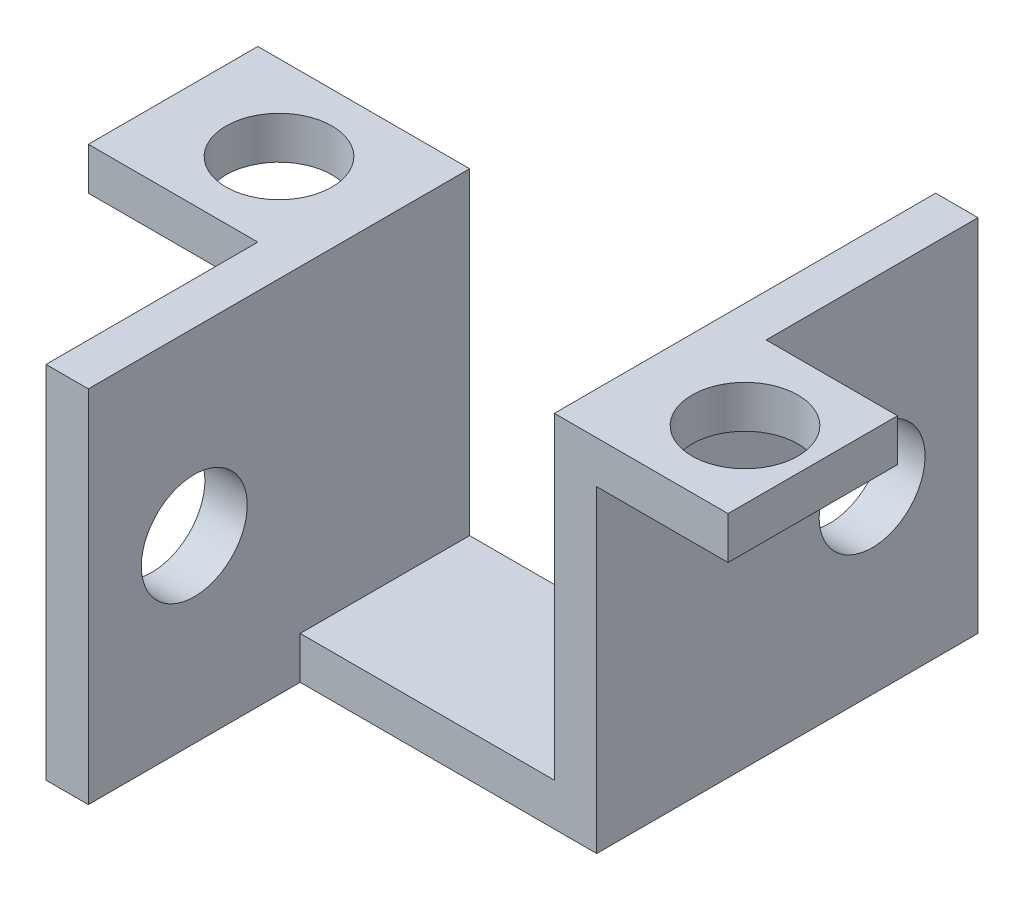
ISO-10303-21;
HEADER;
FILE_DESCRIPTION(('STEP AP214'),'2;1');
FILE_NAME('part.step','',(''),(''),'','','');
FILE_SCHEMA(('AUTOMOTIVE_DESIGN { 1 0 10303 214 1 1 1 1 }'));
ENDSEC;
DATA;
#1=APPLICATION_CONTEXT('core data for automotive mechanical design processes');
#2=APPLICATION_PROTOCOL_DEFINITION('international standard','automotive_design',2000,#1);
#3=PRODUCT_CONTEXT('',#1,'mechanical');
#4=PRODUCT('Part','Part','',(#3));
#5=PRODUCT_RELATED_PRODUCT_CATEGORY('part','',(#4));
#6=PRODUCT_DEFINITION_FORMATION('','',#4);
#7=PRODUCT_DEFINITION_CONTEXT('part definition',#1,'design');
#8=PRODUCT_DEFINITION('design','',#6,#7);
#9=PRODUCT_DEFINITION_SHAPE('','',#8);
#10=(LENGTH_UNIT() NAMED_UNIT(*) SI_UNIT(.MILLI.,.METRE.));
#11=(NAMED_UNIT(*) PLANE_ANGLE_UNIT() SI_UNIT($,.RADIAN.));
#12=(NAMED_UNIT(*) SI_UNIT($,.STERADIAN.) SOLID_ANGLE_UNIT());
#13=UNCERTAINTY_MEASURE_WITH_UNIT(LENGTH_MEASURE(1.E-05),#10,'distance_accuracy_value','');
#14=(GEOMETRIC_REPRESENTATION_CONTEXT(3) GLOBAL_UNCERTAINTY_ASSIGNED_CONTEXT((#13)) GLOBAL_UNIT_ASSIGNED_CONTEXT((#10,
#11,#12)) REPRESENTATION_CONTEXT('',''));
#15=CARTESIAN_POINT('',(0.,0.,0.));
#16=DIRECTION('',(0.,0.,1.));
#17=DIRECTION('',(1.,0.,0.));
#18=AXIS2_PLACEMENT_3D('',#15,#16,#17);
#19=CARTESIAN_POINT('',(0.,0.,0.));
#20=DIRECTION('',(0.,0.,1.));
#21=DIRECTION('',(1.,0.,0.));
#22=AXIS2_PLACEMENT_3D('',#19,#20,#21);
#23=PLANE('',#22);
#24=DIRECTION('',(0.,-1.,0.));
#25=VECTOR('',#24,1.);
#26=CARTESIAN_POINT('',(8.,-9.5,0.));
#27=LINE('',#26,#25);
#28=CARTESIAN_POINT('',(8.,7.5,0.));
#29=VERTEX_POINT('',#28);
#30=CARTESIAN_POINT('',(8.,5.5,0.));
#31=VERTEX_POINT('',#30);
#32=EDGE_CURVE('E188',#29,#31,#27,.T.);
#33=ORIENTED_EDGE('',*,*,#32,.F.);
#34=DIRECTION('',(-1.,0.,0.));
#35=VECTOR('',#34,1.);
#36=CARTESIAN_POINT('',(0.,7.49999999999999,0.));
#37=LINE('',#36,#35);
#38=CARTESIAN_POINT('',(14.2,7.5,0.));
#39=VERTEX_POINT('',#38);
#40=EDGE_CURVE('E306',#39,#29,#37,.T.);
#41=ORIENTED_EDGE('',*,*,#40,.F.);
#42=DIRECTION('',(0.,1.,0.));
#43=VECTOR('',#42,1.);
#44=CARTESIAN_POINT('',(14.2,7.5,0.));
#45=LINE('',#44,#43);
#46=CARTESIAN_POINT('',(14.2,5.5,0.));
#47=VERTEX_POINT('',#46);
#48=EDGE_CURVE('E229',#47,#39,#45,.T.);
#49=ORIENTED_EDGE('',*,*,#48,.F.);
#50=DIRECTION('',(1.,0.,0.));
#51=VECTOR('',#50,1.);
#52=CARTESIAN_POINT('',(0.,5.5,0.));
#53=LINE('',#52,#51);
#54=EDGE_CURVE('E302',#31,#47,#53,.T.);
#55=ORIENTED_EDGE('',*,*,#54,.F.);
#56=EDGE_LOOP('',(#33,#41,#49,#55));
#57=FACE_BOUND('',#56,.T.);
#58=ADVANCED_FACE('F41',(#57),#23,.F.);
#59=CARTESIAN_POINT('',(0.,0.,8.));
#60=DIRECTION('',(0.,0.,1.));
#61=DIRECTION('',(1.,0.,0.));
#62=AXIS2_PLACEMENT_3D('',#59,#60,#61);
#63=PLANE('',#62);
#64=DIRECTION('',(-1.,0.,0.));
#65=VECTOR('',#64,1.);
#66=CARTESIAN_POINT('',(0.,5.5,8.));
#67=LINE('',#66,#65);
#68=CARTESIAN_POINT('',(-8.,5.5,8.));
#69=VERTEX_POINT('',#68);
#70=CARTESIAN_POINT('',(-16.,5.5,8.));
#71=VERTEX_POINT('',#70);
#72=EDGE_CURVE('E259',#69,#71,#67,.T.);
#73=ORIENTED_EDGE('',*,*,#72,.F.);
#74=DIRECTION('',(0.,1.,0.));
#75=VECTOR('',#74,1.);
#76=CARTESIAN_POINT('',(-8.,-9.50000000000001,8.));
#77=LINE('',#76,#75);
#78=CARTESIAN_POINT('',(-8.,7.5,8.));
#79=VERTEX_POINT('',#78);
#80=EDGE_CURVE('E51',#69,#79,#77,.T.);
#81=ORIENTED_EDGE('',*,*,#80,.T.);
#82=DIRECTION('',(-1.,0.,0.));
#83=VECTOR('',#82,1.);
#84=CARTESIAN_POINT('',(0.,7.5,8.));
#85=LINE('',#84,#83);
#86=CARTESIAN_POINT('',(-16.,7.5,8.));
#87=VERTEX_POINT('',#86);
#88=EDGE_CURVE('E252',#79,#87,#85,.T.);
#89=ORIENTED_EDGE('',*,*,#88,.T.);
#90=DIRECTION('',(0.,-1.,0.));
#91=VECTOR('',#90,1.);
#92=CARTESIAN_POINT('',(-16.,0.,8.));
#93=LINE('',#92,#91);
#94=EDGE_CURVE('E255',#87,#71,#93,.T.);
#95=ORIENTED_EDGE('',*,*,#94,.T.);
#96=EDGE_LOOP('',(#73,#81,#89,#95));
#97=FACE_BOUND('',#96,.T.);
#98=ADVANCED_FACE('F365',(#97),#63,.T.);
#99=CARTESIAN_POINT('',(0.,5.5,8.));
#100=DIRECTION('',(0.,1.,0.));
#101=DIRECTION('',(0.,0.,1.));
#102=AXIS2_PLACEMENT_3D('',#99,#100,#101);
#103=PLANE('',#102);
#104=CARTESIAN_POINT('',(11.,5.5,4.));
#105=DIRECTION('',(0.,1.,0.));
#106=DIRECTION('',(-1.,0.,0.));
#107=AXIS2_PLACEMENT_3D('',#104,#105,#106);
#108=CIRCLE('',#107,2.5);
#109=CARTESIAN_POINT('',(8.5,5.5,4.));
#110=VERTEX_POINT('',#109);
#111=EDGE_CURVE('E245',#110,#110,#108,.T.);
#112=ORIENTED_EDGE('',*,*,#111,.T.);
#113=EDGE_LOOP('',(#112));
#114=FACE_BOUND('',#113,.T.);
#115=DIRECTION('',(0.,0.,-1.));
#116=VECTOR('',#115,1.);
#117=CARTESIAN_POINT('',(14.2,5.5,8.));
#118=LINE('',#117,#116);
#119=CARTESIAN_POINT('',(14.2,5.5,8.));
#120=VERTEX_POINT('',#119);
#121=EDGE_CURVE('E226',#120,#47,#118,.T.);
#122=ORIENTED_EDGE('',*,*,#121,.F.);
#123=DIRECTION('',(1.,0.,0.));
#124=VECTOR('',#123,1.);
#125=CARTESIAN_POINT('',(0.,5.5,8.));
#126=LINE('',#125,#124);
#127=CARTESIAN_POINT('',(8.,5.5,8.));
#128=VERTEX_POINT('',#127);
#129=EDGE_CURVE('E270',#128,#120,#126,.T.);
#130=ORIENTED_EDGE('',*,*,#129,.F.);
#131=DIRECTION('',(0.,0.,-1.));
#132=VECTOR('',#131,1.);
#133=CARTESIAN_POINT('',(8.,5.5,8.));
#134=LINE('',#133,#132);
#135=EDGE_CURVE('E328',#128,#31,#134,.T.);
#136=ORIENTED_EDGE('',*,*,#135,.T.);
#137=ORIENTED_EDGE('',*,*,#54,.T.);
#138=EDGE_LOOP('',(#122,#130,#136,#137));
#139=FACE_BOUND('',#138,.T.);
#140=ADVANCED_FACE('F385',(#114,#139),#103,.F.);
#141=CARTESIAN_POINT('',(0.,7.49999999999999,8.));
#142=DIRECTION('',(0.,-1.,0.));
#143=DIRECTION('',(1.,0.,0.));
#144=AXIS2_PLACEMENT_3D('',#141,#142,#143);
#145=PLANE('',#144);
#146=CARTESIAN_POINT('',(11.,7.5,4.));
#147=DIRECTION('',(0.,1.,0.));
#148=DIRECTION('',(-1.,0.,0.));
#149=AXIS2_PLACEMENT_3D('',#146,#147,#148);
#150=CIRCLE('',#149,2.5);
#151=CARTESIAN_POINT('',(8.5,7.5,4.));
#152=VERTEX_POINT('',#151);
#153=EDGE_CURVE('E235',#152,#152,#150,.T.);
#154=ORIENTED_EDGE('',*,*,#153,.F.);
#155=EDGE_LOOP('',(#154));
#156=FACE_BOUND('',#155,.T.);
#157=DIRECTION('',(0.,0.,1.));
#158=VECTOR('',#157,1.);
#159=CARTESIAN_POINT('',(14.2,7.5,8.));
#160=LINE('',#159,#158);
#161=CARTESIAN_POINT('',(14.2,7.5,8.));
#162=VERTEX_POINT('',#161);
#163=EDGE_CURVE('E232',#39,#162,#160,.T.);
#164=ORIENTED_EDGE('',*,*,#163,.F.);
#165=ORIENTED_EDGE('',*,*,#40,.T.);
#166=DIRECTION('',(0.,0.,1.));
#167=VECTOR('',#166,1.);
#168=CARTESIAN_POINT('',(8.,7.5,0.));
#169=LINE('',#168,#167);
#170=CARTESIAN_POINT('',(8.,7.5,-10.));
#171=VERTEX_POINT('',#170);
#172=EDGE_CURVE('E182',#171,#29,#169,.T.);
#173=ORIENTED_EDGE('',*,*,#172,.F.);
#174=DIRECTION('',(1.,0.,0.));
#175=VECTOR('',#174,1.);
#176=CARTESIAN_POINT('',(6.,7.5,-10.));
#177=LINE('',#176,#175);
#178=CARTESIAN_POINT('',(6.,7.5,-10.));
#179=VERTEX_POINT('',#178);
#180=EDGE_CURVE('E167',#179,#171,#177,.T.);
#181=ORIENTED_EDGE('',*,*,#180,.F.);
#182=DIRECTION('',(0.,0.,-1.));
#183=VECTOR('',#182,1.);
#184=CARTESIAN_POINT('',(6.,7.5,8.));
#185=LINE('',#184,#183);
#186=CARTESIAN_POINT('',(6.,7.5,8.));
#187=VERTEX_POINT('',#186);
#188=EDGE_CURVE('E173',#187,#179,#185,.T.);
#189=ORIENTED_EDGE('',*,*,#188,.F.);
#190=DIRECTION('',(-1.,0.,0.));
#191=VECTOR('',#190,1.);
#192=CARTESIAN_POINT('',(0.,7.49999999999999,8.));
#193=LINE('',#192,#191);
#194=EDGE_CURVE('E274',#162,#187,#193,.T.);
#195=ORIENTED_EDGE('',*,*,#194,.F.);
#196=EDGE_LOOP('',(#164,#165,#173,#181,#189,#195));
#197=FACE_BOUND('',#196,.T.);
#198=ADVANCED_FACE('F392',(#156,#197),#145,.F.);
#199=DIRECTION('',(0.,1.,0.));
#200=VECTOR('',#199,1.);
#201=CARTESIAN_POINT('',(-6.,-9.50000000000001,8.));
#202=LINE('',#201,#200);
#203=CARTESIAN_POINT('',(-6.,-9.5,8.));
#204=VERTEX_POINT('',#203);
#205=CARTESIAN_POINT('',(-6.,-7.5,8.));
#206=VERTEX_POINT('',#205);
#207=EDGE_CURVE('E66',#204,#206,#202,.T.);
#208=ORIENTED_EDGE('',*,*,#207,.F.);
#209=DIRECTION('',(-1.,0.,0.));
#210=VECTOR('',#209,1.);
#211=CARTESIAN_POINT('',(0.,-9.5,8.));
#212=LINE('',#211,#210);
#213=CARTESIAN_POINT('',(8.,-9.5,8.));
#214=VERTEX_POINT('',#213);
#215=EDGE_CURVE('E263',#214,#204,#212,.T.);
#216=ORIENTED_EDGE('',*,*,#215,.F.);
#217=DIRECTION('',(0.,-1.,0.));
#218=VECTOR('',#217,1.);
#219=CARTESIAN_POINT('',(8.,0.,8.));
#220=LINE('',#219,#218);
#221=EDGE_CURVE('E266',#128,#214,#220,.T.);
#222=ORIENTED_EDGE('',*,*,#221,.F.);
#223=ORIENTED_EDGE('',*,*,#129,.T.);
#224=DIRECTION('',(0.,-1.,0.));
#225=VECTOR('',#224,1.);
#226=CARTESIAN_POINT('',(14.2,7.5,8.));
#227=LINE('',#226,#225);
#228=EDGE_CURVE('E223',#162,#120,#227,.T.);
#229=ORIENTED_EDGE('',*,*,#228,.F.);
#230=ORIENTED_EDGE('',*,*,#194,.T.);
#231=DIRECTION('',(0.,1.,0.));
#232=VECTOR('',#231,1.);
#233=CARTESIAN_POINT('',(6.,0.,8.));
#234=LINE('',#233,#232);
#235=CARTESIAN_POINT('',(6.,-7.5,8.));
#236=VERTEX_POINT('',#235);
#237=EDGE_CURVE('E277',#236,#187,#234,.T.);
#238=ORIENTED_EDGE('',*,*,#237,.F.);
#239=DIRECTION('',(1.,0.,0.));
#240=VECTOR('',#239,1.);
#241=CARTESIAN_POINT('',(0.,-7.5,8.));
#242=LINE('',#241,#240);
#243=EDGE_CURVE('E280',#206,#236,#242,.T.);
#244=ORIENTED_EDGE('',*,*,#243,.F.);
#245=EDGE_LOOP('',(#208,#216,#222,#223,#229,#230,#238,#244));
#246=FACE_BOUND('',#245,.T.);
#247=ADVANCED_FACE('F376',(#246),#63,.T.);
#248=DIRECTION('',(1.,0.,0.));
#249=VECTOR('',#248,1.);
#250=CARTESIAN_POINT('',(0.,-7.5,0.));
#251=LINE('',#250,#249);
#252=CARTESIAN_POINT('',(-6.,-7.5,0.));
#253=VERTEX_POINT('',#252);
#254=CARTESIAN_POINT('',(6.,-7.5,0.));
#255=VERTEX_POINT('',#254);
#256=EDGE_CURVE('E310',#253,#255,#251,.T.);
#257=ORIENTED_EDGE('',*,*,#256,.T.);
#258=DIRECTION('',(0.,-1.,0.));
#259=VECTOR('',#258,1.);
#260=CARTESIAN_POINT('',(6.,-9.5,0.));
#261=LINE('',#260,#259);
#262=CARTESIAN_POINT('',(6.,-9.5,0.));
#263=VERTEX_POINT('',#262);
#264=EDGE_CURVE('E11',#255,#263,#261,.T.);
#265=ORIENTED_EDGE('',*,*,#264,.T.);
#266=DIRECTION('',(-1.,0.,0.));
#267=VECTOR('',#266,1.);
#268=CARTESIAN_POINT('',(0.,-9.5,0.));
#269=LINE('',#268,#267);
#270=CARTESIAN_POINT('',(-8.,-9.50000000000001,0.));
#271=VERTEX_POINT('',#270);
#272=EDGE_CURVE('E180',#263,#271,#269,.T.);
#273=ORIENTED_EDGE('',*,*,#272,.T.);
#274=DIRECTION('',(0.,-1.,0.));
#275=VECTOR('',#274,1.);
#276=CARTESIAN_POINT('',(-8.,0.,0.));
#277=LINE('',#276,#275);
#278=CARTESIAN_POINT('',(-8.,5.5,0.));
#279=VERTEX_POINT('',#278);
#280=EDGE_CURVE('E296',#279,#271,#277,.T.);
#281=ORIENTED_EDGE('',*,*,#280,.F.);
#282=DIRECTION('',(-1.,0.,0.));
#283=VECTOR('',#282,1.);
#284=CARTESIAN_POINT('',(0.,5.5,0.));
#285=LINE('',#284,#283);
#286=CARTESIAN_POINT('',(-16.,5.5,0.));
#287=VERTEX_POINT('',#286);
#288=EDGE_CURVE('E292',#279,#287,#285,.T.);
#289=ORIENTED_EDGE('',*,*,#288,.T.);
#290=DIRECTION('',(0.,-1.,0.));
#291=VECTOR('',#290,1.);
#292=CARTESIAN_POINT('',(-16.,0.,0.));
#293=LINE('',#292,#291);
#294=CARTESIAN_POINT('',(-16.,7.5,0.));
#295=VERTEX_POINT('',#294);
#296=EDGE_CURVE('E288',#295,#287,#293,.T.);
#297=ORIENTED_EDGE('',*,*,#296,.F.);
#298=DIRECTION('',(-1.,0.,0.));
#299=VECTOR('',#298,1.);
#300=CARTESIAN_POINT('',(0.,7.5,0.));
#301=LINE('',#300,#299);
#302=CARTESIAN_POINT('',(-6.,7.5,0.));
#303=VERTEX_POINT('',#302);
#304=EDGE_CURVE('E240',#303,#295,#301,.T.);
#305=ORIENTED_EDGE('',*,*,#304,.F.);
#306=DIRECTION('',(0.,1.,0.));
#307=VECTOR('',#306,1.);
#308=CARTESIAN_POINT('',(-6.,0.,0.));
#309=LINE('',#308,#307);
#310=EDGE_CURVE('E256',#253,#303,#309,.T.);
#311=ORIENTED_EDGE('',*,*,#310,.F.);
#312=EDGE_LOOP('',(#257,#265,#273,#281,#289,#297,#305,#311));
#313=FACE_BOUND('',#312,.T.);
#314=ADVANCED_FACE('F357',(#313),#23,.F.);
#315=CARTESIAN_POINT('',(0.,7.5,8.));
#316=DIRECTION('',(0.,-1.,0.));
#317=DIRECTION('',(1.,0.,0.));
#318=AXIS2_PLACEMENT_3D('',#315,#316,#317);
#319=PLANE('',#318);
#320=CARTESIAN_POINT('',(-11.,7.49999999999998,4.));
#321=DIRECTION('',(0.,1.,0.));
#322=DIRECTION('',(-1.,0.,0.));
#323=AXIS2_PLACEMENT_3D('',#320,#321,#322);
#324=CIRCLE('',#323,2.5);
#325=CARTESIAN_POINT('',(-13.5,7.49999999999998,4.));
#326=VERTEX_POINT('',#325);
#327=EDGE_CURVE('E241',#326,#326,#324,.T.);
#328=ORIENTED_EDGE('',*,*,#327,.F.);
#329=EDGE_LOOP('',(#328));
#330=FACE_BOUND('',#329,.T.);
#331=ORIENTED_EDGE('',*,*,#304,.T.);
#332=DIRECTION('',(0.,0.,-1.));
#333=VECTOR('',#332,1.);
#334=CARTESIAN_POINT('',(-16.,7.5,8.));
#335=LINE('',#334,#333);
#336=EDGE_CURVE('E45',#87,#295,#335,.T.);
#337=ORIENTED_EDGE('',*,*,#336,.F.);
#338=ORIENTED_EDGE('',*,*,#88,.F.);
#339=DIRECTION('',(0.,0.,1.));
#340=VECTOR('',#339,1.);
#341=CARTESIAN_POINT('',(-8.,7.5,8.));
#342=LINE('',#341,#340);
#343=CARTESIAN_POINT('',(-8.,7.5,18.));
#344=VERTEX_POINT('',#343);
#345=EDGE_CURVE('E195',#79,#344,#342,.T.);
#346=ORIENTED_EDGE('',*,*,#345,.T.);
#347=DIRECTION('',(-1.,0.,0.));
#348=VECTOR('',#347,1.);
#349=CARTESIAN_POINT('',(-6.,7.5,18.));
#350=LINE('',#349,#348);
#351=CARTESIAN_POINT('',(-6.,7.5,18.));
#352=VERTEX_POINT('',#351);
#353=EDGE_CURVE('E220',#352,#344,#350,.T.);
#354=ORIENTED_EDGE('',*,*,#353,.F.);
#355=DIRECTION('',(0.,0.,-1.));
#356=VECTOR('',#355,1.);
#357=CARTESIAN_POINT('',(-6.,7.5,8.));
#358=LINE('',#357,#356);
#359=EDGE_CURVE('E284',#352,#303,#358,.T.);
#360=ORIENTED_EDGE('',*,*,#359,.T.);
#361=EDGE_LOOP('',(#331,#337,#338,#346,#354,#360));
#362=FACE_BOUND('',#361,.T.);
#363=ADVANCED_FACE('F43',(#330,#362),#319,.F.);
#364=CARTESIAN_POINT('',(-16.,0.,8.));
#365=DIRECTION('',(1.,0.,0.));
#366=DIRECTION('',(0.,0.,-1.));
#367=AXIS2_PLACEMENT_3D('',#364,#365,#366);
#368=PLANE('',#367);
#369=ORIENTED_EDGE('',*,*,#296,.T.);
#370=DIRECTION('',(0.,0.,-1.));
#371=VECTOR('',#370,1.);
#372=CARTESIAN_POINT('',(-16.,5.5,8.));
#373=LINE('',#372,#371);
#374=EDGE_CURVE('E340',#71,#287,#373,.T.);
#375=ORIENTED_EDGE('',*,*,#374,.F.);
#376=ORIENTED_EDGE('',*,*,#94,.F.);
#377=ORIENTED_EDGE('',*,*,#336,.T.);
#378=EDGE_LOOP('',(#369,#375,#376,#377));
#379=FACE_BOUND('',#378,.T.);
#380=ADVANCED_FACE('F350',(#379),#368,.F.);
#381=CARTESIAN_POINT('',(0.,5.5,8.));
#382=DIRECTION('',(0.,-1.,0.));
#383=DIRECTION('',(1.,0.,0.));
#384=AXIS2_PLACEMENT_3D('',#381,#382,#383);
#385=PLANE('',#384);
#386=CARTESIAN_POINT('',(-11.,5.49999999999998,4.));
#387=DIRECTION('',(0.,1.,0.));
#388=DIRECTION('',(-1.,0.,0.));
#389=AXIS2_PLACEMENT_3D('',#386,#387,#388);
#390=CIRCLE('',#389,2.5);
#391=CARTESIAN_POINT('',(-13.5,5.49999999999998,4.));
#392=VERTEX_POINT('',#391);
#393=EDGE_CURVE('E236',#392,#392,#390,.T.);
#394=ORIENTED_EDGE('',*,*,#393,.T.);
#395=EDGE_LOOP('',(#394));
#396=FACE_BOUND('',#395,.T.);
#397=ORIENTED_EDGE('',*,*,#288,.F.);
#398=DIRECTION('',(0.,0.,-1.));
#399=VECTOR('',#398,1.);
#400=CARTESIAN_POINT('',(-8.,5.5,8.));
#401=LINE('',#400,#399);
#402=EDGE_CURVE('E338',#69,#279,#401,.T.);
#403=ORIENTED_EDGE('',*,*,#402,.F.);
#404=ORIENTED_EDGE('',*,*,#72,.T.);
#405=ORIENTED_EDGE('',*,*,#374,.T.);
#406=EDGE_LOOP('',(#397,#403,#404,#405));
#407=FACE_BOUND('',#406,.T.);
#408=ADVANCED_FACE('F360',(#396,#407),#385,.T.);
#409=CARTESIAN_POINT('',(-8.,0.,8.));
#410=DIRECTION('',(1.,0.,0.));
#411=DIRECTION('',(0.,0.,-1.));
#412=AXIS2_PLACEMENT_3D('',#409,#410,#411);
#413=PLANE('',#412);
#414=CARTESIAN_POINT('',(-8.,-1.,13.));
#415=DIRECTION('',(-1.,0.,0.));
#416=DIRECTION('',(0.,0.,1.));
#417=AXIS2_PLACEMENT_3D('',#414,#415,#416);
#418=CIRCLE('',#417,2.5);
#419=CARTESIAN_POINT('',(-8.,-1.,15.5));
#420=VERTEX_POINT('',#419);
#421=EDGE_CURVE('E462',#420,#420,#418,.T.);
#422=ORIENTED_EDGE('',*,*,#421,.F.);
#423=EDGE_LOOP('',(#422));
#424=FACE_BOUND('',#423,.T.);
#425=ORIENTED_EDGE('',*,*,#280,.T.);
#426=DIRECTION('',(0.,0.,-1.));
#427=VECTOR('',#426,1.);
#428=CARTESIAN_POINT('',(-8.,-9.50000000000001,8.));
#429=LINE('',#428,#427);
#430=CARTESIAN_POINT('',(-8.,-9.50000000000001,18.));
#431=VERTEX_POINT('',#430);
#432=EDGE_CURVE('E335',#431,#271,#429,.T.);
#433=ORIENTED_EDGE('',*,*,#432,.F.);
#434=DIRECTION('',(0.,1.,0.));
#435=VECTOR('',#434,1.);
#436=CARTESIAN_POINT('',(-8.,-9.50000000000001,18.));
#437=LINE('',#436,#435);
#438=EDGE_CURVE('E202',#431,#344,#437,.T.);
#439=ORIENTED_EDGE('',*,*,#438,.T.);
#440=ORIENTED_EDGE('',*,*,#345,.F.);
#441=ORIENTED_EDGE('',*,*,#80,.F.);
#442=ORIENTED_EDGE('',*,*,#402,.T.);
#443=EDGE_LOOP('',(#425,#433,#439,#440,#441,#442));
#444=FACE_BOUND('',#443,.T.);
#445=ADVANCED_FACE('F367',(#424,#444),#413,.F.);
#446=CARTESIAN_POINT('',(0.,-9.5,8.));
#447=DIRECTION('',(0.,-1.,0.));
#448=DIRECTION('',(1.,0.,0.));
#449=AXIS2_PLACEMENT_3D('',#446,#447,#448);
#450=PLANE('',#449);
#451=ORIENTED_EDGE('',*,*,#272,.F.);
#452=DIRECTION('',(0.,0.,-1.));
#453=VECTOR('',#452,1.);
#454=CARTESIAN_POINT('',(6.,-9.5,0.));
#455=LINE('',#454,#453);
#456=CARTESIAN_POINT('',(6.,-9.5,-10.));
#457=VERTEX_POINT('',#456);
#458=EDGE_CURVE('E59',#263,#457,#455,.T.);
#459=ORIENTED_EDGE('',*,*,#458,.T.);
#460=DIRECTION('',(1.,0.,0.));
#461=VECTOR('',#460,1.);
#462=CARTESIAN_POINT('',(6.,-9.5,-10.));
#463=LINE('',#462,#461);
#464=CARTESIAN_POINT('',(8.,-9.5,-10.));
#465=VERTEX_POINT('',#464);
#466=EDGE_CURVE('E160',#457,#465,#463,.T.);
#467=ORIENTED_EDGE('',*,*,#466,.T.);
#468=DIRECTION('',(0.,0.,-1.));
#469=VECTOR('',#468,1.);
#470=CARTESIAN_POINT('',(8.,-9.5,8.));
#471=LINE('',#470,#469);
#472=EDGE_CURVE('E332',#214,#465,#471,.T.);
#473=ORIENTED_EDGE('',*,*,#472,.F.);
#474=ORIENTED_EDGE('',*,*,#215,.T.);
#475=DIRECTION('',(0.,0.,1.));
#476=VECTOR('',#475,1.);
#477=CARTESIAN_POINT('',(-6.,-9.50000000000001,8.));
#478=LINE('',#477,#476);
#479=CARTESIAN_POINT('',(-6.,-9.50000000000001,18.));
#480=VERTEX_POINT('',#479);
#481=EDGE_CURVE('E201',#204,#480,#478,.T.);
#482=ORIENTED_EDGE('',*,*,#481,.T.);
#483=DIRECTION('',(-1.,0.,0.));
#484=VECTOR('',#483,1.);
#485=CARTESIAN_POINT('',(-6.,-9.50000000000001,18.));
#486=LINE('',#485,#484);
#487=EDGE_CURVE('E208',#480,#431,#486,.T.);
#488=ORIENTED_EDGE('',*,*,#487,.T.);
#489=ORIENTED_EDGE('',*,*,#432,.T.);
#490=EDGE_LOOP('',(#451,#459,#467,#473,#474,#482,#488,#489));
#491=FACE_BOUND('',#490,.T.);
#492=ADVANCED_FACE('F178',(#491),#450,.T.);
#493=CARTESIAN_POINT('',(8.,0.,8.));
#494=DIRECTION('',(1.,0.,0.));
#495=DIRECTION('',(0.,1.,0.));
#496=AXIS2_PLACEMENT_3D('',#493,#494,#495);
#497=PLANE('',#496);
#498=ORIENTED_EDGE('',*,*,#472,.T.);
#499=DIRECTION('',(0.,1.,0.));
#500=VECTOR('',#499,1.);
#501=CARTESIAN_POINT('',(8.,-9.5,-10.));
#502=LINE('',#501,#500);
#503=EDGE_CURVE('E164',#465,#171,#502,.T.);
#504=ORIENTED_EDGE('',*,*,#503,.T.);
#505=ORIENTED_EDGE('',*,*,#172,.T.);
#506=ORIENTED_EDGE('',*,*,#32,.T.);
#507=ORIENTED_EDGE('',*,*,#135,.F.);
#508=ORIENTED_EDGE('',*,*,#221,.T.);
#509=EDGE_LOOP('',(#498,#504,#505,#506,#507,#508));
#510=FACE_BOUND('',#509,.T.);
#511=CARTESIAN_POINT('',(8.,-1.,-5.));
#512=DIRECTION('',(1.,0.,0.));
#513=DIRECTION('',(0.,1.,0.));
#514=AXIS2_PLACEMENT_3D('',#511,#512,#513);
#515=CIRCLE('',#514,2.5);
#516=CARTESIAN_POINT('',(8.,1.5,-5.));
#517=VERTEX_POINT('',#516);
#518=EDGE_CURVE('E467',#517,#517,#515,.T.);
#519=ORIENTED_EDGE('',*,*,#518,.F.);
#520=EDGE_LOOP('',(#519));
#521=FACE_BOUND('',#520,.T.);
#522=ADVANCED_FACE('F378',(#510,#521),#497,.T.);
#523=CARTESIAN_POINT('',(6.,0.,8.));
#524=DIRECTION('',(-1.,0.,0.));
#525=DIRECTION('',(0.,0.,1.));
#526=AXIS2_PLACEMENT_3D('',#523,#524,#525);
#527=PLANE('',#526);
#528=ORIENTED_EDGE('',*,*,#188,.T.);
#529=DIRECTION('',(0.,1.,0.));
#530=VECTOR('',#529,1.);
#531=CARTESIAN_POINT('',(6.,-9.5,-10.));
#532=LINE('',#531,#530);
#533=EDGE_CURVE('E162',#457,#179,#532,.T.);
#534=ORIENTED_EDGE('',*,*,#533,.F.);
#535=ORIENTED_EDGE('',*,*,#458,.F.);
#536=ORIENTED_EDGE('',*,*,#264,.F.);
#537=DIRECTION('',(0.,0.,-1.));
#538=VECTOR('',#537,1.);
#539=CARTESIAN_POINT('',(6.,-7.5,8.));
#540=LINE('',#539,#538);
#541=EDGE_CURVE('E322',#236,#255,#540,.T.);
#542=ORIENTED_EDGE('',*,*,#541,.F.);
#543=ORIENTED_EDGE('',*,*,#237,.T.);
#544=EDGE_LOOP('',(#528,#534,#535,#536,#542,#543));
#545=FACE_BOUND('',#544,.T.);
#546=CARTESIAN_POINT('',(6.,-1.,-5.));
#547=DIRECTION('',(1.,0.,0.));
#548=DIRECTION('',(0.,1.,0.));
#549=AXIS2_PLACEMENT_3D('',#546,#547,#548);
#550=CIRCLE('',#549,2.5);
#551=CARTESIAN_POINT('',(6.,1.5,-5.));
#552=VERTEX_POINT('',#551);
#553=EDGE_CURVE('E191',#552,#552,#550,.T.);
#554=ORIENTED_EDGE('',*,*,#553,.T.);
#555=EDGE_LOOP('',(#554));
#556=FACE_BOUND('',#555,.T.);
#557=ADVANCED_FACE('F169',(#545,#556),#527,.T.);
#558=CARTESIAN_POINT('',(0.,-7.5,8.));
#559=DIRECTION('',(0.,1.,0.));
#560=DIRECTION('',(0.,0.,1.));
#561=AXIS2_PLACEMENT_3D('',#558,#559,#560);
#562=PLANE('',#561);
#563=ORIENTED_EDGE('',*,*,#256,.F.);
#564=DIRECTION('',(0.,0.,-1.));
#565=VECTOR('',#564,1.);
#566=CARTESIAN_POINT('',(-6.,-7.5,8.));
#567=LINE('',#566,#565);
#568=EDGE_CURVE('E319',#206,#253,#567,.T.);
#569=ORIENTED_EDGE('',*,*,#568,.F.);
#570=ORIENTED_EDGE('',*,*,#243,.T.);
#571=ORIENTED_EDGE('',*,*,#541,.T.);
#572=EDGE_LOOP('',(#563,#569,#570,#571));
#573=FACE_BOUND('',#572,.T.);
#574=ADVANCED_FACE('F396',(#573),#562,.T.);
#575=CARTESIAN_POINT('',(-6.,0.,8.));
#576=DIRECTION('',(-1.,0.,0.));
#577=DIRECTION('',(0.,0.,1.));
#578=AXIS2_PLACEMENT_3D('',#575,#576,#577);
#579=PLANE('',#578);
#580=CARTESIAN_POINT('',(-6.,-1.,13.));
#581=DIRECTION('',(-1.,0.,0.));
#582=DIRECTION('',(0.,0.,1.));
#583=AXIS2_PLACEMENT_3D('',#580,#581,#582);
#584=CIRCLE('',#583,2.5);
#585=CARTESIAN_POINT('',(-6.,-1.,15.5));
#586=VERTEX_POINT('',#585);
#587=EDGE_CURVE('E459',#586,#586,#584,.T.);
#588=ORIENTED_EDGE('',*,*,#587,.T.);
#589=EDGE_LOOP('',(#588));
#590=FACE_BOUND('',#589,.T.);
#591=ORIENTED_EDGE('',*,*,#310,.T.);
#592=ORIENTED_EDGE('',*,*,#359,.F.);
#593=DIRECTION('',(0.,1.,0.));
#594=VECTOR('',#593,1.);
#595=CARTESIAN_POINT('',(-6.,-9.50000000000001,18.));
#596=LINE('',#595,#594);
#597=EDGE_CURVE('E197',#480,#352,#596,.T.);
#598=ORIENTED_EDGE('',*,*,#597,.F.);
#599=ORIENTED_EDGE('',*,*,#481,.F.);
#600=ORIENTED_EDGE('',*,*,#207,.T.);
#601=ORIENTED_EDGE('',*,*,#568,.T.);
#602=EDGE_LOOP('',(#591,#592,#598,#599,#600,#601));
#603=FACE_BOUND('',#602,.T.);
#604=ADVANCED_FACE('F374',(#590,#603),#579,.F.);
#605=CARTESIAN_POINT('',(11.,5.5,4.));
#606=DIRECTION('',(0.,1.,0.));
#607=DIRECTION('',(-1.,0.,0.));
#608=AXIS2_PLACEMENT_3D('',#605,#606,#607);
#609=CYLINDRICAL_SURFACE('',#608,2.5);
#610=ORIENTED_EDGE('',*,*,#111,.F.);
#611=EDGE_LOOP('',(#610));
#612=FACE_BOUND('',#611,.T.);
#613=ORIENTED_EDGE('',*,*,#153,.T.);
#614=EDGE_LOOP('',(#613));
#615=FACE_BOUND('',#614,.T.);
#616=ADVANCED_FACE('F404',(#612,#615),#609,.F.);
#617=CARTESIAN_POINT('',(-11.,5.49999999999998,4.));
#618=DIRECTION('',(0.,1.,0.));
#619=DIRECTION('',(-1.,0.,0.));
#620=AXIS2_PLACEMENT_3D('',#617,#618,#619);
#621=CYLINDRICAL_SURFACE('',#620,2.5);
#622=ORIENTED_EDGE('',*,*,#393,.F.);
#623=EDGE_LOOP('',(#622));
#624=FACE_BOUND('',#623,.T.);
#625=ORIENTED_EDGE('',*,*,#327,.T.);
#626=EDGE_LOOP('',(#625));
#627=FACE_BOUND('',#626,.T.);
#628=ADVANCED_FACE('F435',(#624,#627),#621,.F.);
#629=CARTESIAN_POINT('',(14.2,0.,0.));
#630=DIRECTION('',(1.,0.,0.));
#631=DIRECTION('',(0.,0.,-1.));
#632=AXIS2_PLACEMENT_3D('',#629,#630,#631);
#633=PLANE('',#632);
#634=ORIENTED_EDGE('',*,*,#228,.T.);
#635=ORIENTED_EDGE('',*,*,#121,.T.);
#636=ORIENTED_EDGE('',*,*,#48,.T.);
#637=ORIENTED_EDGE('',*,*,#163,.T.);
#638=EDGE_LOOP('',(#634,#635,#636,#637));
#639=FACE_BOUND('',#638,.T.);
#640=ADVANCED_FACE('F439',(#639),#633,.T.);
#641=CARTESIAN_POINT('',(-6.,-9.50000000000001,18.));
#642=DIRECTION('',(0.,0.,1.));
#643=DIRECTION('',(1.,0.,0.));
#644=AXIS2_PLACEMENT_3D('',#641,#642,#643);
#645=PLANE('',#644);
#646=ORIENTED_EDGE('',*,*,#438,.F.);
#647=ORIENTED_EDGE('',*,*,#487,.F.);
#648=ORIENTED_EDGE('',*,*,#597,.T.);
#649=ORIENTED_EDGE('',*,*,#353,.T.);
#650=EDGE_LOOP('',(#646,#647,#648,#649));
#651=FACE_BOUND('',#650,.T.);
#652=ADVANCED_FACE('F371',(#651),#645,.T.);
#653=CARTESIAN_POINT('',(6.,-9.5,-10.));
#654=DIRECTION('',(0.,0.,-1.));
#655=DIRECTION('',(-1.,0.,0.));
#656=AXIS2_PLACEMENT_3D('',#653,#654,#655);
#657=PLANE('',#656);
#658=ORIENTED_EDGE('',*,*,#503,.F.);
#659=ORIENTED_EDGE('',*,*,#466,.F.);
#660=ORIENTED_EDGE('',*,*,#533,.T.);
#661=ORIENTED_EDGE('',*,*,#180,.T.);
#662=EDGE_LOOP('',(#658,#659,#660,#661));
#663=FACE_BOUND('',#662,.T.);
#664=ADVANCED_FACE('F161',(#663),#657,.T.);
#665=CARTESIAN_POINT('',(6.,-1.,-5.));
#666=DIRECTION('',(1.,0.,0.));
#667=DIRECTION('',(0.,1.,0.));
#668=AXIS2_PLACEMENT_3D('',#665,#666,#667);
#669=CYLINDRICAL_SURFACE('',#668,2.5);
#670=ORIENTED_EDGE('',*,*,#553,.F.);
#671=EDGE_LOOP('',(#670));
#672=FACE_BOUND('',#671,.T.);
#673=ORIENTED_EDGE('',*,*,#518,.T.);
#674=EDGE_LOOP('',(#673));
#675=FACE_BOUND('',#674,.T.);
#676=ADVANCED_FACE('F447',(#672,#675),#669,.F.);
#677=CARTESIAN_POINT('',(-6.,-1.,13.));
#678=DIRECTION('',(-1.,0.,0.));
#679=DIRECTION('',(0.,0.,1.));
#680=AXIS2_PLACEMENT_3D('',#677,#678,#679);
#681=CYLINDRICAL_SURFACE('',#680,2.5);
#682=ORIENTED_EDGE('',*,*,#587,.F.);
#683=EDGE_LOOP('',(#682));
#684=FACE_BOUND('',#683,.T.);
#685=ORIENTED_EDGE('',*,*,#421,.T.);
#686=EDGE_LOOP('',(#685));
#687=FACE_BOUND('',#686,.T.);
#688=ADVANCED_FACE('F450',(#684,#687),#681,.F.);
#689=CLOSED_SHELL('',(#58,#98,#140,#198,#247,#314,#363,#380,#408,#445,#492,#522,#557,#574,#604,
#616,#628,#640,#652,#664,#676,#688));
#690=MANIFOLD_SOLID_BREP('B2',#689);
#691=ADVANCED_BREP_SHAPE_REPRESENTATION('',(#18,#690),#14);
#692=SHAPE_DEFINITION_REPRESENTATION(#9,#691);
ENDSEC;
END-ISO-10303-21;
